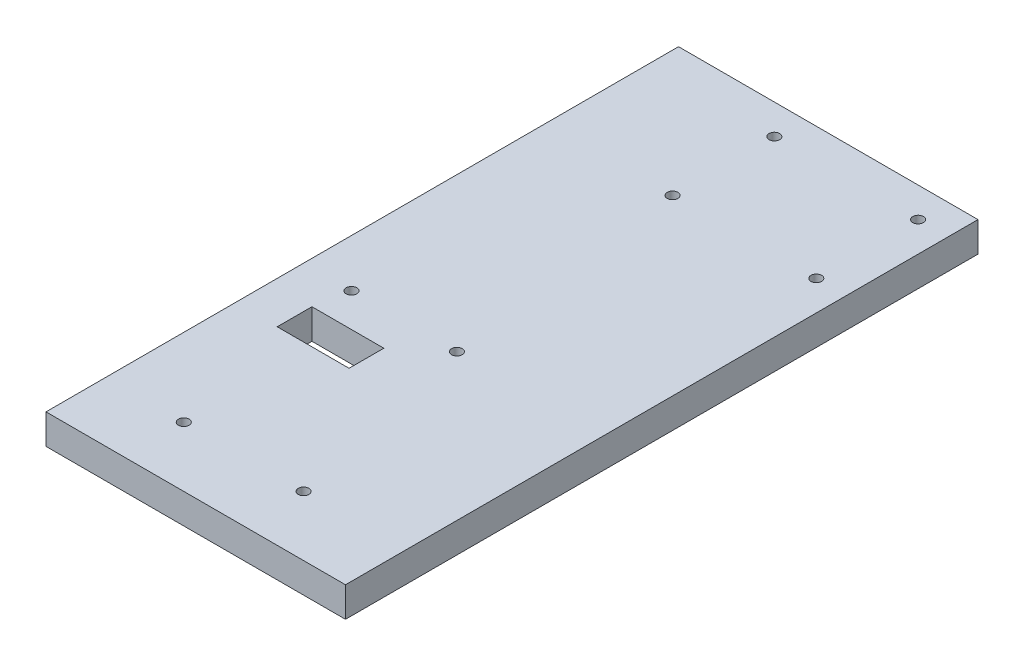
ISO-10303-21;
HEADER;
FILE_DESCRIPTION(('STEP AP214'),'2;1');
FILE_NAME('part.step','',(''),(''),'','','');
FILE_SCHEMA(('AUTOMOTIVE_DESIGN { 1 0 10303 214 1 1 1 1 }'));
ENDSEC;
DATA;
#1=APPLICATION_CONTEXT('core data for automotive mechanical design processes');
#2=APPLICATION_PROTOCOL_DEFINITION('international standard','automotive_design',2000,#1);
#3=PRODUCT_CONTEXT('',#1,'mechanical');
#4=PRODUCT('Part','Part','',(#3));
#5=PRODUCT_RELATED_PRODUCT_CATEGORY('part','',(#4));
#6=PRODUCT_DEFINITION_FORMATION('','',#4);
#7=PRODUCT_DEFINITION_CONTEXT('part definition',#1,'design');
#8=PRODUCT_DEFINITION('design','',#6,#7);
#9=PRODUCT_DEFINITION_SHAPE('','',#8);
#10=(LENGTH_UNIT() NAMED_UNIT(*) SI_UNIT(.MILLI.,.METRE.));
#11=(NAMED_UNIT(*) PLANE_ANGLE_UNIT() SI_UNIT($,.RADIAN.));
#12=(NAMED_UNIT(*) SI_UNIT($,.STERADIAN.) SOLID_ANGLE_UNIT());
#13=UNCERTAINTY_MEASURE_WITH_UNIT(LENGTH_MEASURE(1.E-05),#10,'distance_accuracy_value','');
#14=(GEOMETRIC_REPRESENTATION_CONTEXT(3) GLOBAL_UNCERTAINTY_ASSIGNED_CONTEXT((#13)) GLOBAL_UNIT_ASSIGNED_CONTEXT((#10,
#11,#12)) REPRESENTATION_CONTEXT('',''));
#15=CARTESIAN_POINT('',(0.,0.,0.));
#16=DIRECTION('',(0.,0.,1.));
#17=DIRECTION('',(1.,0.,0.));
#18=AXIS2_PLACEMENT_3D('',#15,#16,#17);
#19=CARTESIAN_POINT('',(0.,6.35,0.));
#20=DIRECTION('',(1.,0.,0.));
#21=DIRECTION('',(0.,0.,-1.));
#22=AXIS2_PLACEMENT_3D('',#19,#20,#21);
#23=PLANE('',#22);
#24=DIRECTION('',(0.,0.,1.));
#25=VECTOR('',#24,1.);
#26=CARTESIAN_POINT('',(0.,0.,0.));
#27=LINE('',#26,#25);
#28=CARTESIAN_POINT('',(0.,0.,-134.112));
#29=VERTEX_POINT('',#28);
#30=CARTESIAN_POINT('',(0.,0.,0.));
#31=VERTEX_POINT('',#30);
#32=EDGE_CURVE('E132',#29,#31,#27,.T.);
#33=ORIENTED_EDGE('',*,*,#32,.T.);
#34=DIRECTION('',(0.,-1.,0.));
#35=VECTOR('',#34,1.);
#36=CARTESIAN_POINT('',(0.,6.35,0.));
#37=LINE('',#36,#35);
#38=CARTESIAN_POINT('',(0.,6.35,0.));
#39=VERTEX_POINT('',#38);
#40=EDGE_CURVE('E11',#39,#31,#37,.T.);
#41=ORIENTED_EDGE('',*,*,#40,.F.);
#42=DIRECTION('',(0.,0.,1.));
#43=VECTOR('',#42,1.);
#44=CARTESIAN_POINT('',(0.,6.35,0.));
#45=LINE('',#44,#43);
#46=CARTESIAN_POINT('',(0.,6.35,-134.112));
#47=VERTEX_POINT('',#46);
#48=EDGE_CURVE('E136',#47,#39,#45,.T.);
#49=ORIENTED_EDGE('',*,*,#48,.F.);
#50=DIRECTION('',(0.,-1.,0.));
#51=VECTOR('',#50,1.);
#52=CARTESIAN_POINT('',(0.,6.35,-134.112));
#53=LINE('',#52,#51);
#54=EDGE_CURVE('E146',#47,#29,#53,.T.);
#55=ORIENTED_EDGE('',*,*,#54,.T.);
#56=EDGE_LOOP('',(#33,#41,#49,#55));
#57=FACE_BOUND('',#56,.T.);
#58=ADVANCED_FACE('F32',(#57),#23,.F.);
#59=CARTESIAN_POINT('',(0.,6.35,0.));
#60=DIRECTION('',(0.,0.,-1.));
#61=DIRECTION('',(-1.,0.,0.));
#62=AXIS2_PLACEMENT_3D('',#59,#60,#61);
#63=PLANE('',#62);
#64=DIRECTION('',(1.,0.,0.));
#65=VECTOR('',#64,1.);
#66=CARTESIAN_POINT('',(0.,0.,0.));
#67=LINE('',#66,#65);
#68=CARTESIAN_POINT('',(63.5,0.,0.));
#69=VERTEX_POINT('',#68);
#70=EDGE_CURVE('E149',#31,#69,#67,.T.);
#71=ORIENTED_EDGE('',*,*,#70,.T.);
#72=DIRECTION('',(0.,-1.,0.));
#73=VECTOR('',#72,1.);
#74=CARTESIAN_POINT('',(63.5,6.35,0.));
#75=LINE('',#74,#73);
#76=CARTESIAN_POINT('',(63.5,6.35,0.));
#77=VERTEX_POINT('',#76);
#78=EDGE_CURVE('E39',#77,#69,#75,.T.);
#79=ORIENTED_EDGE('',*,*,#78,.F.);
#80=DIRECTION('',(1.,0.,0.));
#81=VECTOR('',#80,1.);
#82=CARTESIAN_POINT('',(0.,6.35,0.));
#83=LINE('',#82,#81);
#84=EDGE_CURVE('E139',#39,#77,#83,.T.);
#85=ORIENTED_EDGE('',*,*,#84,.F.);
#86=ORIENTED_EDGE('',*,*,#40,.T.);
#87=EDGE_LOOP('',(#71,#79,#85,#86));
#88=FACE_BOUND('',#87,.T.);
#89=ADVANCED_FACE('F177',(#88),#63,.F.);
#90=CARTESIAN_POINT('',(63.5,6.35,0.));
#91=DIRECTION('',(-1.,0.,0.));
#92=DIRECTION('',(0.,0.,1.));
#93=AXIS2_PLACEMENT_3D('',#90,#91,#92);
#94=PLANE('',#93);
#95=DIRECTION('',(0.,0.,-1.));
#96=VECTOR('',#95,1.);
#97=CARTESIAN_POINT('',(63.5,0.,0.));
#98=LINE('',#97,#96);
#99=CARTESIAN_POINT('',(63.5,0.,-134.112));
#100=VERTEX_POINT('',#99);
#101=EDGE_CURVE('E151',#69,#100,#98,.T.);
#102=ORIENTED_EDGE('',*,*,#101,.T.);
#103=DIRECTION('',(0.,-1.,0.));
#104=VECTOR('',#103,1.);
#105=CARTESIAN_POINT('',(63.5,6.35,-134.112));
#106=LINE('',#105,#104);
#107=CARTESIAN_POINT('',(63.5,6.35,-134.112));
#108=VERTEX_POINT('',#107);
#109=EDGE_CURVE('E156',#108,#100,#106,.T.);
#110=ORIENTED_EDGE('',*,*,#109,.F.);
#111=DIRECTION('',(0.,0.,-1.));
#112=VECTOR('',#111,1.);
#113=CARTESIAN_POINT('',(63.5,6.35,0.));
#114=LINE('',#113,#112);
#115=EDGE_CURVE('E142',#77,#108,#114,.T.);
#116=ORIENTED_EDGE('',*,*,#115,.F.);
#117=ORIENTED_EDGE('',*,*,#78,.T.);
#118=EDGE_LOOP('',(#102,#110,#116,#117));
#119=FACE_BOUND('',#118,.T.);
#120=ADVANCED_FACE('F163',(#119),#94,.F.);
#121=CARTESIAN_POINT('',(0.,6.35,-134.112));
#122=DIRECTION('',(0.,0.,1.));
#123=DIRECTION('',(1.,0.,0.));
#124=AXIS2_PLACEMENT_3D('',#121,#122,#123);
#125=PLANE('',#124);
#126=DIRECTION('',(-1.,0.,0.));
#127=VECTOR('',#126,1.);
#128=CARTESIAN_POINT('',(0.,0.,-134.112));
#129=LINE('',#128,#127);
#130=EDGE_CURVE('E140',#100,#29,#129,.T.);
#131=ORIENTED_EDGE('',*,*,#130,.T.);
#132=ORIENTED_EDGE('',*,*,#54,.F.);
#133=DIRECTION('',(-1.,0.,0.));
#134=VECTOR('',#133,1.);
#135=CARTESIAN_POINT('',(0.,6.35,-134.112));
#136=LINE('',#135,#134);
#137=EDGE_CURVE('E144',#108,#47,#136,.T.);
#138=ORIENTED_EDGE('',*,*,#137,.F.);
#139=ORIENTED_EDGE('',*,*,#109,.T.);
#140=EDGE_LOOP('',(#131,#132,#138,#139));
#141=FACE_BOUND('',#140,.T.);
#142=ADVANCED_FACE('F170',(#141),#125,.F.);
#143=CARTESIAN_POINT('',(0.,6.35,0.));
#144=DIRECTION('',(0.,-1.,0.));
#145=DIRECTION('',(0.,0.,-1.));
#146=AXIS2_PLACEMENT_3D('',#143,#144,#145);
#147=PLANE('',#146);
#148=CARTESIAN_POINT('',(41.91,6.35,-12.7));
#149=DIRECTION('',(0.,1.,0.));
#150=DIRECTION('',(0.,0.,1.));
#151=AXIS2_PLACEMENT_3D('',#148,#149,#150);
#152=CIRCLE('',#151,1.13029999999999);
#153=CARTESIAN_POINT('',(41.91,6.35,-11.5697));
#154=VERTEX_POINT('',#153);
#155=EDGE_CURVE('E243',#154,#154,#152,.T.);
#156=ORIENTED_EDGE('',*,*,#155,.F.);
#157=EDGE_LOOP('',(#156));
#158=FACE_BOUND('',#157,.T.);
#159=CARTESIAN_POINT('',(16.51,6.35,-12.7));
#160=DIRECTION('',(0.,1.,0.));
#161=DIRECTION('',(0.,0.,1.));
#162=AXIS2_PLACEMENT_3D('',#159,#160,#161);
#163=CIRCLE('',#162,1.13029999999999);
#164=CARTESIAN_POINT('',(16.51,6.35,-11.5697));
#165=VERTEX_POINT('',#164);
#166=EDGE_CURVE('E245',#165,#165,#163,.T.);
#167=ORIENTED_EDGE('',*,*,#166,.F.);
#168=EDGE_LOOP('',(#167));
#169=FACE_BOUND('',#168,.T.);
#170=CARTESIAN_POINT('',(32.512,6.35,-54.61));
#171=DIRECTION('',(0.,1.,0.));
#172=DIRECTION('',(0.,0.,1.));
#173=AXIS2_PLACEMENT_3D('',#170,#171,#172);
#174=CIRCLE('',#173,1.13029999999999);
#175=CARTESIAN_POINT('',(32.512,6.35,-53.4797));
#176=VERTEX_POINT('',#175);
#177=EDGE_CURVE('E253',#176,#176,#174,.T.);
#178=ORIENTED_EDGE('',*,*,#177,.F.);
#179=EDGE_LOOP('',(#178));
#180=FACE_BOUND('',#179,.T.);
#181=CARTESIAN_POINT('',(10.16,6.35,-54.61));
#182=DIRECTION('',(0.,1.,0.));
#183=DIRECTION('',(0.,0.,1.));
#184=AXIS2_PLACEMENT_3D('',#181,#182,#183);
#185=CIRCLE('',#184,1.13029999999999);
#186=CARTESIAN_POINT('',(10.16,6.35,-53.4797));
#187=VERTEX_POINT('',#186);
#188=EDGE_CURVE('E259',#187,#187,#185,.T.);
#189=ORIENTED_EDGE('',*,*,#188,.F.);
#190=EDGE_LOOP('',(#189));
#191=FACE_BOUND('',#190,.T.);
#192=CARTESIAN_POINT('',(57.15,6.35,-127.762));
#193=DIRECTION('',(0.,1.,0.));
#194=DIRECTION('',(0.,0.,1.));
#195=AXIS2_PLACEMENT_3D('',#192,#193,#194);
#196=CIRCLE('',#195,1.13029999999999);
#197=CARTESIAN_POINT('',(57.15,6.35,-126.6317));
#198=VERTEX_POINT('',#197);
#199=EDGE_CURVE('E265',#198,#198,#196,.T.);
#200=ORIENTED_EDGE('',*,*,#199,.F.);
#201=EDGE_LOOP('',(#200));
#202=FACE_BOUND('',#201,.T.);
#203=CARTESIAN_POINT('',(57.15,6.35,-106.172));
#204=DIRECTION('',(0.,1.,0.));
#205=DIRECTION('',(0.,0.,1.));
#206=AXIS2_PLACEMENT_3D('',#203,#204,#205);
#207=CIRCLE('',#206,1.13029999999999);
#208=CARTESIAN_POINT('',(57.15,6.35,-105.0417));
#209=VERTEX_POINT('',#208);
#210=EDGE_CURVE('E271',#209,#209,#207,.T.);
#211=ORIENTED_EDGE('',*,*,#210,.F.);
#212=EDGE_LOOP('',(#211));
#213=FACE_BOUND('',#212,.T.);
#214=CARTESIAN_POINT('',(26.67,6.35,-106.172));
#215=DIRECTION('',(0.,1.,0.));
#216=DIRECTION('',(0.,0.,1.));
#217=AXIS2_PLACEMENT_3D('',#214,#215,#216);
#218=CIRCLE('',#217,1.13029999999999);
#219=CARTESIAN_POINT('',(26.67,6.35,-105.0417));
#220=VERTEX_POINT('',#219);
#221=EDGE_CURVE('E277',#220,#220,#218,.T.);
#222=ORIENTED_EDGE('',*,*,#221,.F.);
#223=EDGE_LOOP('',(#222));
#224=FACE_BOUND('',#223,.T.);
#225=CARTESIAN_POINT('',(26.67,6.35,-127.762));
#226=DIRECTION('',(0.,1.,0.));
#227=DIRECTION('',(0.,0.,1.));
#228=AXIS2_PLACEMENT_3D('',#225,#226,#227);
#229=CIRCLE('',#228,1.13029999999999);
#230=CARTESIAN_POINT('',(26.67,6.35,-126.6317));
#231=VERTEX_POINT('',#230);
#232=EDGE_CURVE('E282',#231,#231,#229,.T.);
#233=ORIENTED_EDGE('',*,*,#232,.F.);
#234=EDGE_LOOP('',(#233));
#235=FACE_BOUND('',#234,.T.);
#236=DIRECTION('',(-1.,0.,0.));
#237=VECTOR('',#236,1.);
#238=CARTESIAN_POINT('',(8.89,6.35,-47.498));
#239=LINE('',#238,#237);
#240=CARTESIAN_POINT('',(24.13,6.35,-47.498));
#241=VERTEX_POINT('',#240);
#242=CARTESIAN_POINT('',(8.89,6.35,-47.498));
#243=VERTEX_POINT('',#242);
#244=EDGE_CURVE('E126',#241,#243,#239,.T.);
#245=ORIENTED_EDGE('',*,*,#244,.F.);
#246=DIRECTION('',(0.,0.,-1.));
#247=VECTOR('',#246,1.);
#248=CARTESIAN_POINT('',(24.13,6.35,-47.498));
#249=LINE('',#248,#247);
#250=CARTESIAN_POINT('',(24.13,6.35,-40.132));
#251=VERTEX_POINT('',#250);
#252=EDGE_CURVE('E46',#251,#241,#249,.T.);
#253=ORIENTED_EDGE('',*,*,#252,.F.);
#254=DIRECTION('',(1.,0.,0.));
#255=VECTOR('',#254,1.);
#256=CARTESIAN_POINT('',(8.89,6.35,-40.132));
#257=LINE('',#256,#255);
#258=CARTESIAN_POINT('',(8.89,6.35,-40.132));
#259=VERTEX_POINT('',#258);
#260=EDGE_CURVE('E114',#259,#251,#257,.T.);
#261=ORIENTED_EDGE('',*,*,#260,.F.);
#262=DIRECTION('',(0.,0.,1.));
#263=VECTOR('',#262,1.);
#264=CARTESIAN_POINT('',(8.89,6.35,-47.498));
#265=LINE('',#264,#263);
#266=EDGE_CURVE('E117',#243,#259,#265,.T.);
#267=ORIENTED_EDGE('',*,*,#266,.F.);
#268=EDGE_LOOP('',(#245,#253,#261,#267));
#269=FACE_BOUND('',#268,.T.);
#270=ORIENTED_EDGE('',*,*,#48,.T.);
#271=ORIENTED_EDGE('',*,*,#84,.T.);
#272=ORIENTED_EDGE('',*,*,#115,.T.);
#273=ORIENTED_EDGE('',*,*,#137,.T.);
#274=EDGE_LOOP('',(#270,#271,#272,#273));
#275=FACE_BOUND('',#274,.T.);
#276=ADVANCED_FACE('F176',(#158,#169,#180,#191,#202,#213,#224,#235,#269,#275),#147,.F.);
#277=CARTESIAN_POINT('',(0.,0.,0.));
#278=DIRECTION('',(0.,-1.,0.));
#279=DIRECTION('',(0.,0.,-1.));
#280=AXIS2_PLACEMENT_3D('',#277,#278,#279);
#281=PLANE('',#280);
#282=CARTESIAN_POINT('',(41.91,0.,-12.7));
#283=DIRECTION('',(0.,1.,0.));
#284=DIRECTION('',(0.,0.,1.));
#285=AXIS2_PLACEMENT_3D('',#282,#283,#284);
#286=CIRCLE('',#285,1.1303);
#287=CARTESIAN_POINT('',(41.91,0.,-11.5697));
#288=VERTEX_POINT('',#287);
#289=EDGE_CURVE('E240',#288,#288,#286,.T.);
#290=ORIENTED_EDGE('',*,*,#289,.T.);
#291=EDGE_LOOP('',(#290));
#292=FACE_BOUND('',#291,.T.);
#293=CARTESIAN_POINT('',(16.51,0.,-12.7));
#294=DIRECTION('',(0.,1.,0.));
#295=DIRECTION('',(0.,0.,1.));
#296=AXIS2_PLACEMENT_3D('',#293,#294,#295);
#297=CIRCLE('',#296,1.1303);
#298=CARTESIAN_POINT('',(16.51,0.,-11.5697));
#299=VERTEX_POINT('',#298);
#300=EDGE_CURVE('E250',#299,#299,#297,.T.);
#301=ORIENTED_EDGE('',*,*,#300,.T.);
#302=EDGE_LOOP('',(#301));
#303=FACE_BOUND('',#302,.T.);
#304=CARTESIAN_POINT('',(32.512,0.,-54.61));
#305=DIRECTION('',(0.,1.,0.));
#306=DIRECTION('',(0.,0.,1.));
#307=AXIS2_PLACEMENT_3D('',#304,#305,#306);
#308=CIRCLE('',#307,1.1303);
#309=CARTESIAN_POINT('',(32.512,0.,-53.4797));
#310=VERTEX_POINT('',#309);
#311=EDGE_CURVE('E256',#310,#310,#308,.T.);
#312=ORIENTED_EDGE('',*,*,#311,.T.);
#313=EDGE_LOOP('',(#312));
#314=FACE_BOUND('',#313,.T.);
#315=CARTESIAN_POINT('',(10.16,0.,-54.61));
#316=DIRECTION('',(0.,1.,0.));
#317=DIRECTION('',(0.,0.,1.));
#318=AXIS2_PLACEMENT_3D('',#315,#316,#317);
#319=CIRCLE('',#318,1.1303);
#320=CARTESIAN_POINT('',(10.16,0.,-53.4797));
#321=VERTEX_POINT('',#320);
#322=EDGE_CURVE('E262',#321,#321,#319,.T.);
#323=ORIENTED_EDGE('',*,*,#322,.T.);
#324=EDGE_LOOP('',(#323));
#325=FACE_BOUND('',#324,.T.);
#326=CARTESIAN_POINT('',(57.15,0.,-127.762));
#327=DIRECTION('',(0.,1.,0.));
#328=DIRECTION('',(0.,0.,1.));
#329=AXIS2_PLACEMENT_3D('',#326,#327,#328);
#330=CIRCLE('',#329,1.1303);
#331=CARTESIAN_POINT('',(57.15,0.,-126.6317));
#332=VERTEX_POINT('',#331);
#333=EDGE_CURVE('E268',#332,#332,#330,.T.);
#334=ORIENTED_EDGE('',*,*,#333,.T.);
#335=EDGE_LOOP('',(#334));
#336=FACE_BOUND('',#335,.T.);
#337=CARTESIAN_POINT('',(57.15,0.,-106.172));
#338=DIRECTION('',(0.,1.,0.));
#339=DIRECTION('',(0.,0.,1.));
#340=AXIS2_PLACEMENT_3D('',#337,#338,#339);
#341=CIRCLE('',#340,1.1303);
#342=CARTESIAN_POINT('',(57.15,0.,-105.0417));
#343=VERTEX_POINT('',#342);
#344=EDGE_CURVE('E274',#343,#343,#341,.T.);
#345=ORIENTED_EDGE('',*,*,#344,.T.);
#346=EDGE_LOOP('',(#345));
#347=FACE_BOUND('',#346,.T.);
#348=CARTESIAN_POINT('',(26.67,0.,-106.172));
#349=DIRECTION('',(0.,1.,0.));
#350=DIRECTION('',(0.,0.,1.));
#351=AXIS2_PLACEMENT_3D('',#348,#349,#350);
#352=CIRCLE('',#351,1.1303);
#353=CARTESIAN_POINT('',(26.67,0.,-105.0417));
#354=VERTEX_POINT('',#353);
#355=EDGE_CURVE('E280',#354,#354,#352,.T.);
#356=ORIENTED_EDGE('',*,*,#355,.T.);
#357=EDGE_LOOP('',(#356));
#358=FACE_BOUND('',#357,.T.);
#359=CARTESIAN_POINT('',(26.67,0.,-127.762));
#360=DIRECTION('',(0.,1.,0.));
#361=DIRECTION('',(0.,0.,1.));
#362=AXIS2_PLACEMENT_3D('',#359,#360,#361);
#363=CIRCLE('',#362,1.1303);
#364=CARTESIAN_POINT('',(26.67,0.,-126.6317));
#365=VERTEX_POINT('',#364);
#366=EDGE_CURVE('E120',#365,#365,#363,.T.);
#367=ORIENTED_EDGE('',*,*,#366,.T.);
#368=EDGE_LOOP('',(#367));
#369=FACE_BOUND('',#368,.T.);
#370=DIRECTION('',(0.,0.,-1.));
#371=VECTOR('',#370,1.);
#372=CARTESIAN_POINT('',(24.13,0.,-47.498));
#373=LINE('',#372,#371);
#374=CARTESIAN_POINT('',(24.13,0.,-40.132));
#375=VERTEX_POINT('',#374);
#376=CARTESIAN_POINT('',(24.13,0.,-47.498));
#377=VERTEX_POINT('',#376);
#378=EDGE_CURVE('E98',#375,#377,#373,.T.);
#379=ORIENTED_EDGE('',*,*,#378,.T.);
#380=DIRECTION('',(-1.,0.,0.));
#381=VECTOR('',#380,1.);
#382=CARTESIAN_POINT('',(8.89,0.,-47.498));
#383=LINE('',#382,#381);
#384=CARTESIAN_POINT('',(8.89,0.,-47.498));
#385=VERTEX_POINT('',#384);
#386=EDGE_CURVE('E107',#377,#385,#383,.T.);
#387=ORIENTED_EDGE('',*,*,#386,.T.);
#388=DIRECTION('',(0.,0.,1.));
#389=VECTOR('',#388,1.);
#390=CARTESIAN_POINT('',(8.89,0.,-47.498));
#391=LINE('',#390,#389);
#392=CARTESIAN_POINT('',(8.89,0.,-40.132));
#393=VERTEX_POINT('',#392);
#394=EDGE_CURVE('E54',#385,#393,#391,.T.);
#395=ORIENTED_EDGE('',*,*,#394,.T.);
#396=DIRECTION('',(1.,0.,0.));
#397=VECTOR('',#396,1.);
#398=CARTESIAN_POINT('',(8.89,0.,-40.132));
#399=LINE('',#398,#397);
#400=EDGE_CURVE('E104',#393,#375,#399,.T.);
#401=ORIENTED_EDGE('',*,*,#400,.T.);
#402=EDGE_LOOP('',(#379,#387,#395,#401));
#403=FACE_BOUND('',#402,.T.);
#404=ORIENTED_EDGE('',*,*,#32,.F.);
#405=ORIENTED_EDGE('',*,*,#130,.F.);
#406=ORIENTED_EDGE('',*,*,#101,.F.);
#407=ORIENTED_EDGE('',*,*,#70,.F.);
#408=EDGE_LOOP('',(#404,#405,#406,#407));
#409=FACE_BOUND('',#408,.T.);
#410=ADVANCED_FACE('F111',(#292,#303,#314,#325,#336,#347,#358,#369,#403,#409),#281,.T.);
#411=CARTESIAN_POINT('',(24.13,0.,-47.498));
#412=DIRECTION('',(1.,0.,0.));
#413=DIRECTION('',(0.,0.,-1.));
#414=AXIS2_PLACEMENT_3D('',#411,#412,#413);
#415=PLANE('',#414);
#416=ORIENTED_EDGE('',*,*,#252,.T.);
#417=DIRECTION('',(0.,1.,0.));
#418=VECTOR('',#417,1.);
#419=CARTESIAN_POINT('',(24.13,0.,-47.498));
#420=LINE('',#419,#418);
#421=EDGE_CURVE('E94',#377,#241,#420,.T.);
#422=ORIENTED_EDGE('',*,*,#421,.F.);
#423=ORIENTED_EDGE('',*,*,#378,.F.);
#424=DIRECTION('',(0.,1.,0.));
#425=VECTOR('',#424,1.);
#426=CARTESIAN_POINT('',(24.13,0.,-40.132));
#427=LINE('',#426,#425);
#428=EDGE_CURVE('E130',#375,#251,#427,.T.);
#429=ORIENTED_EDGE('',*,*,#428,.T.);
#430=EDGE_LOOP('',(#416,#422,#423,#429));
#431=FACE_BOUND('',#430,.T.);
#432=ADVANCED_FACE('F96',(#431),#415,.F.);
#433=CARTESIAN_POINT('',(8.89,0.,-40.132));
#434=DIRECTION('',(0.,0.,1.));
#435=DIRECTION('',(1.,0.,0.));
#436=AXIS2_PLACEMENT_3D('',#433,#434,#435);
#437=PLANE('',#436);
#438=ORIENTED_EDGE('',*,*,#260,.T.);
#439=ORIENTED_EDGE('',*,*,#428,.F.);
#440=ORIENTED_EDGE('',*,*,#400,.F.);
#441=DIRECTION('',(0.,1.,0.));
#442=VECTOR('',#441,1.);
#443=CARTESIAN_POINT('',(8.89,0.,-40.132));
#444=LINE('',#443,#442);
#445=EDGE_CURVE('E133',#393,#259,#444,.T.);
#446=ORIENTED_EDGE('',*,*,#445,.T.);
#447=EDGE_LOOP('',(#438,#439,#440,#446));
#448=FACE_BOUND('',#447,.T.);
#449=ADVANCED_FACE('F195',(#448),#437,.F.);
#450=CARTESIAN_POINT('',(8.89,0.,-47.498));
#451=DIRECTION('',(-1.,0.,0.));
#452=DIRECTION('',(0.,0.,1.));
#453=AXIS2_PLACEMENT_3D('',#450,#451,#452);
#454=PLANE('',#453);
#455=ORIENTED_EDGE('',*,*,#266,.T.);
#456=ORIENTED_EDGE('',*,*,#445,.F.);
#457=ORIENTED_EDGE('',*,*,#394,.F.);
#458=DIRECTION('',(0.,1.,0.));
#459=VECTOR('',#458,1.);
#460=CARTESIAN_POINT('',(8.89,0.,-47.498));
#461=LINE('',#460,#459);
#462=EDGE_CURVE('E103',#385,#243,#461,.T.);
#463=ORIENTED_EDGE('',*,*,#462,.T.);
#464=EDGE_LOOP('',(#455,#456,#457,#463));
#465=FACE_BOUND('',#464,.T.);
#466=ADVANCED_FACE('F199',(#465),#454,.F.);
#467=CARTESIAN_POINT('',(8.89,0.,-47.498));
#468=DIRECTION('',(0.,0.,-1.));
#469=DIRECTION('',(-1.,0.,0.));
#470=AXIS2_PLACEMENT_3D('',#467,#468,#469);
#471=PLANE('',#470);
#472=ORIENTED_EDGE('',*,*,#244,.T.);
#473=ORIENTED_EDGE('',*,*,#462,.F.);
#474=ORIENTED_EDGE('',*,*,#386,.F.);
#475=ORIENTED_EDGE('',*,*,#421,.T.);
#476=EDGE_LOOP('',(#472,#473,#474,#475));
#477=FACE_BOUND('',#476,.T.);
#478=ADVANCED_FACE('F108',(#477),#471,.F.);
#479=CARTESIAN_POINT('',(26.67,6.35,-127.762));
#480=DIRECTION('',(0.,1.,0.));
#481=DIRECTION('',(0.,0.,1.));
#482=AXIS2_PLACEMENT_3D('',#479,#480,#481);
#483=CYLINDRICAL_SURFACE('',#482,1.13029999999999);
#484=ORIENTED_EDGE('',*,*,#366,.F.);
#485=EDGE_LOOP('',(#484));
#486=FACE_BOUND('',#485,.T.);
#487=ORIENTED_EDGE('',*,*,#232,.T.);
#488=EDGE_LOOP('',(#487));
#489=FACE_BOUND('',#488,.T.);
#490=ADVANCED_FACE('F198',(#486,#489),#483,.F.);
#491=CARTESIAN_POINT('',(26.67,6.35,-106.172));
#492=DIRECTION('',(0.,1.,0.));
#493=DIRECTION('',(0.,0.,1.));
#494=AXIS2_PLACEMENT_3D('',#491,#492,#493);
#495=CYLINDRICAL_SURFACE('',#494,1.13029999999999);
#496=ORIENTED_EDGE('',*,*,#355,.F.);
#497=EDGE_LOOP('',(#496));
#498=FACE_BOUND('',#497,.T.);
#499=ORIENTED_EDGE('',*,*,#221,.T.);
#500=EDGE_LOOP('',(#499));
#501=FACE_BOUND('',#500,.T.);
#502=ADVANCED_FACE('F207',(#498,#501),#495,.F.);
#503=CARTESIAN_POINT('',(57.15,6.35,-106.172));
#504=DIRECTION('',(0.,1.,0.));
#505=DIRECTION('',(0.,0.,1.));
#506=AXIS2_PLACEMENT_3D('',#503,#504,#505);
#507=CYLINDRICAL_SURFACE('',#506,1.13029999999999);
#508=ORIENTED_EDGE('',*,*,#344,.F.);
#509=EDGE_LOOP('',(#508));
#510=FACE_BOUND('',#509,.T.);
#511=ORIENTED_EDGE('',*,*,#210,.T.);
#512=EDGE_LOOP('',(#511));
#513=FACE_BOUND('',#512,.T.);
#514=ADVANCED_FACE('F211',(#510,#513),#507,.F.);
#515=CARTESIAN_POINT('',(57.15,6.35,-127.762));
#516=DIRECTION('',(0.,1.,0.));
#517=DIRECTION('',(0.,0.,1.));
#518=AXIS2_PLACEMENT_3D('',#515,#516,#517);
#519=CYLINDRICAL_SURFACE('',#518,1.13029999999999);
#520=ORIENTED_EDGE('',*,*,#333,.F.);
#521=EDGE_LOOP('',(#520));
#522=FACE_BOUND('',#521,.T.);
#523=ORIENTED_EDGE('',*,*,#199,.T.);
#524=EDGE_LOOP('',(#523));
#525=FACE_BOUND('',#524,.T.);
#526=ADVANCED_FACE('F215',(#522,#525),#519,.F.);
#527=CARTESIAN_POINT('',(10.16,6.35,-54.61));
#528=DIRECTION('',(0.,1.,0.));
#529=DIRECTION('',(0.,0.,1.));
#530=AXIS2_PLACEMENT_3D('',#527,#528,#529);
#531=CYLINDRICAL_SURFACE('',#530,1.13029999999999);
#532=ORIENTED_EDGE('',*,*,#322,.F.);
#533=EDGE_LOOP('',(#532));
#534=FACE_BOUND('',#533,.T.);
#535=ORIENTED_EDGE('',*,*,#188,.T.);
#536=EDGE_LOOP('',(#535));
#537=FACE_BOUND('',#536,.T.);
#538=ADVANCED_FACE('F219',(#534,#537),#531,.F.);
#539=CARTESIAN_POINT('',(32.512,6.35,-54.61));
#540=DIRECTION('',(0.,1.,0.));
#541=DIRECTION('',(0.,0.,1.));
#542=AXIS2_PLACEMENT_3D('',#539,#540,#541);
#543=CYLINDRICAL_SURFACE('',#542,1.13029999999999);
#544=ORIENTED_EDGE('',*,*,#311,.F.);
#545=EDGE_LOOP('',(#544));
#546=FACE_BOUND('',#545,.T.);
#547=ORIENTED_EDGE('',*,*,#177,.T.);
#548=EDGE_LOOP('',(#547));
#549=FACE_BOUND('',#548,.T.);
#550=ADVANCED_FACE('F223',(#546,#549),#543,.F.);
#551=CARTESIAN_POINT('',(16.51,6.35,-12.7));
#552=DIRECTION('',(0.,1.,0.));
#553=DIRECTION('',(0.,0.,1.));
#554=AXIS2_PLACEMENT_3D('',#551,#552,#553);
#555=CYLINDRICAL_SURFACE('',#554,1.13029999999999);
#556=ORIENTED_EDGE('',*,*,#300,.F.);
#557=EDGE_LOOP('',(#556));
#558=FACE_BOUND('',#557,.T.);
#559=ORIENTED_EDGE('',*,*,#166,.T.);
#560=EDGE_LOOP('',(#559));
#561=FACE_BOUND('',#560,.T.);
#562=ADVANCED_FACE('F227',(#558,#561),#555,.F.);
#563=CARTESIAN_POINT('',(41.91,6.35,-12.7));
#564=DIRECTION('',(0.,1.,0.));
#565=DIRECTION('',(0.,0.,1.));
#566=AXIS2_PLACEMENT_3D('',#563,#564,#565);
#567=CYLINDRICAL_SURFACE('',#566,1.13029999999999);
#568=ORIENTED_EDGE('',*,*,#289,.F.);
#569=EDGE_LOOP('',(#568));
#570=FACE_BOUND('',#569,.T.);
#571=ORIENTED_EDGE('',*,*,#155,.T.);
#572=EDGE_LOOP('',(#571));
#573=FACE_BOUND('',#572,.T.);
#574=ADVANCED_FACE('F231',(#570,#573),#567,.F.);
#575=CLOSED_SHELL('',(#58,#89,#120,#142,#276,#410,#432,#449,#466,#478,#490,#502,#514,#526,#538,
#550,#562,#574));
#576=MANIFOLD_SOLID_BREP('B2',#575);
#577=ADVANCED_BREP_SHAPE_REPRESENTATION('',(#18,#576),#14);
#578=SHAPE_DEFINITION_REPRESENTATION(#9,#577);
ENDSEC;
END-ISO-10303-21;
